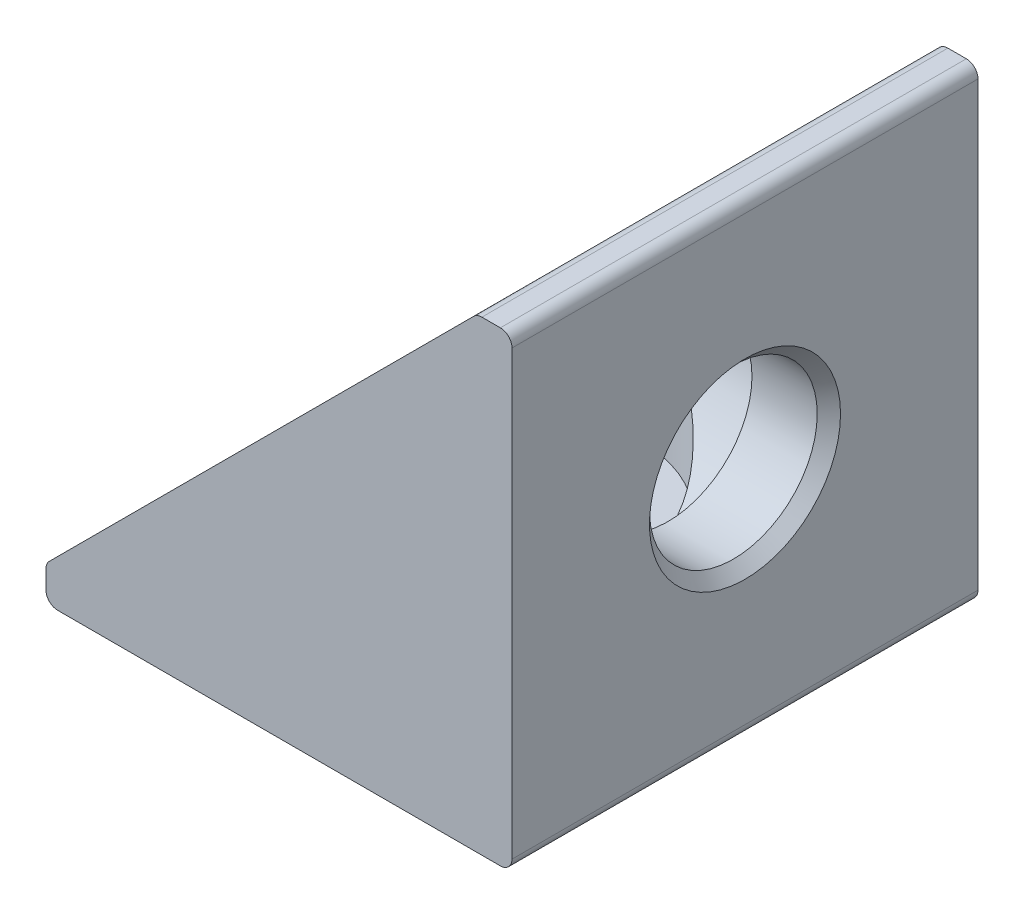
ISO-10303-21;
HEADER;
FILE_DESCRIPTION(('STEP AP214'),'2;1');
FILE_NAME('part.step','',(''),(''),'','','');
FILE_SCHEMA(('AUTOMOTIVE_DESIGN { 1 0 10303 214 1 1 1 1 }'));
ENDSEC;
DATA;
#1=APPLICATION_CONTEXT('core data for automotive mechanical design processes');
#2=APPLICATION_PROTOCOL_DEFINITION('international standard','automotive_design',2000,#1);
#3=PRODUCT_CONTEXT('',#1,'mechanical');
#4=PRODUCT('Part','Part','',(#3));
#5=PRODUCT_RELATED_PRODUCT_CATEGORY('part','',(#4));
#6=PRODUCT_DEFINITION_FORMATION('','',#4);
#7=PRODUCT_DEFINITION_CONTEXT('part definition',#1,'design');
#8=PRODUCT_DEFINITION('design','',#6,#7);
#9=PRODUCT_DEFINITION_SHAPE('','',#8);
#10=(LENGTH_UNIT() NAMED_UNIT(*) SI_UNIT(.MILLI.,.METRE.));
#11=(NAMED_UNIT(*) PLANE_ANGLE_UNIT() SI_UNIT($,.RADIAN.));
#12=(NAMED_UNIT(*) SI_UNIT($,.STERADIAN.) SOLID_ANGLE_UNIT());
#13=UNCERTAINTY_MEASURE_WITH_UNIT(LENGTH_MEASURE(1.E-05),#10,'distance_accuracy_value','');
#14=(GEOMETRIC_REPRESENTATION_CONTEXT(3) GLOBAL_UNCERTAINTY_ASSIGNED_CONTEXT((#13)) GLOBAL_UNIT_ASSIGNED_CONTEXT((#10,
#11,#12)) REPRESENTATION_CONTEXT('',''));
#15=CARTESIAN_POINT('',(0.,0.,0.));
#16=DIRECTION('',(0.,0.,1.));
#17=DIRECTION('',(1.,0.,0.));
#18=AXIS2_PLACEMENT_3D('',#15,#16,#17);
#19=CARTESIAN_POINT('',(-20.,1.5,-20.));
#20=DIRECTION('',(-0.707106781186548,0.707106781186547,0.));
#21=DIRECTION('',(-0.707106781186547,-0.707106781186548,0.));
#22=AXIS2_PLACEMENT_3D('',#19,#20,#21);
#23=PLANE('',#22);
#24=CARTESIAN_POINT('',(-10.,11.5,-10.));
#25=DIRECTION('',(-0.707106781186548,0.707106781186547,0.));
#26=DIRECTION('',(-0.707106781186547,-0.707106781186548,0.));
#27=AXIS2_PLACEMENT_3D('',#24,#25,#26);
#28=ELLIPSE('',#27,7.77817459305202,5.5);
#29=CARTESIAN_POINT('',(-10.75,10.75,-4.55137632057416));
#30=VERTEX_POINT('',#29);
#31=CARTESIAN_POINT('',(-10.75,10.75,-15.4486236794258));
#32=VERTEX_POINT('',#31);
#33=EDGE_CURVE('E127',#30,#32,#28,.T.);
#34=ORIENTED_EDGE('',*,*,#33,.F.);
#35=CARTESIAN_POINT('',(-11.5,10.,-10.));
#36=DIRECTION('',(-0.707106781186548,0.707106781186547,0.));
#37=DIRECTION('',(0.707106781186547,0.707106781186548,0.));
#38=AXIS2_PLACEMENT_3D('',#35,#36,#37);
#39=ELLIPSE('',#38,7.77817459305202,5.5);
#40=EDGE_CURVE('E124',#30,#32,#39,.F.);
#41=ORIENTED_EDGE('',*,*,#40,.T.);
#42=EDGE_LOOP('',(#34,#41));
#43=FACE_BOUND('',#42,.T.);
#44=DIRECTION('',(-0.707106781186547,-0.707106781186548,0.));
#45=VECTOR('',#44,1.);
#46=CARTESIAN_POINT('',(-20.,1.5,0.));
#47=LINE('',#46,#45);
#48=CARTESIAN_POINT('',(-1.64644660940673,19.8535533905933,0.));
#49=VERTEX_POINT('',#48);
#50=CARTESIAN_POINT('',(-19.8535533905933,1.64644660940673,0.));
#51=VERTEX_POINT('',#50);
#52=EDGE_CURVE('E270',#49,#51,#47,.T.);
#53=ORIENTED_EDGE('',*,*,#52,.F.);
#54=DIRECTION('',(0.,0.,1.));
#55=VECTOR('',#54,1.);
#56=CARTESIAN_POINT('',(-1.64644660940673,19.8535533905933,-20.));
#57=LINE('',#56,#55);
#58=CARTESIAN_POINT('',(-1.64644660940673,19.8535533905933,-20.));
#59=VERTEX_POINT('',#58);
#60=EDGE_CURVE('E153',#49,#59,#57,.F.);
#61=ORIENTED_EDGE('',*,*,#60,.T.);
#62=DIRECTION('',(-0.707106781186547,-0.707106781186548,0.));
#63=VECTOR('',#62,1.);
#64=CARTESIAN_POINT('',(-20.,1.5,-20.));
#65=LINE('',#64,#63);
#66=CARTESIAN_POINT('',(-19.8535533905933,1.64644660940673,-20.));
#67=VERTEX_POINT('',#66);
#68=EDGE_CURVE('E278',#59,#67,#65,.T.);
#69=ORIENTED_EDGE('',*,*,#68,.T.);
#70=DIRECTION('',(0.,0.,1.));
#71=VECTOR('',#70,1.);
#72=CARTESIAN_POINT('',(-19.8535533905933,1.64644660940673,-20.));
#73=LINE('',#72,#71);
#74=EDGE_CURVE('E150',#67,#51,#73,.T.);
#75=ORIENTED_EDGE('',*,*,#74,.T.);
#76=EDGE_LOOP('',(#53,#61,#69,#75));
#77=FACE_BOUND('',#76,.T.);
#78=ADVANCED_FACE('F16',(#43,#77),#23,.T.);
#79=CARTESIAN_POINT('',(-10.,16.3,-10.));
#80=DIRECTION('',(0.,-1.,0.));
#81=DIRECTION('',(1.,0.,0.));
#82=AXIS2_PLACEMENT_3D('',#79,#80,#81);
#83=CYLINDRICAL_SURFACE('',#82,5.5);
#84=CARTESIAN_POINT('',(-10.,10.,-10.));
#85=DIRECTION('',(-0.707106781186547,-0.707106781186548,0.));
#86=DIRECTION('',(0.707106781186548,-0.707106781186547,0.));
#87=AXIS2_PLACEMENT_3D('',#84,#85,#86);
#88=ELLIPSE('',#87,7.77817459305202,5.5);
#89=CARTESIAN_POINT('',(-10.,10.,-4.5));
#90=VERTEX_POINT('',#89);
#91=EDGE_CURVE('E117',#30,#90,#88,.F.);
#92=ORIENTED_EDGE('',*,*,#91,.F.);
#93=ORIENTED_EDGE('',*,*,#33,.T.);
#94=CARTESIAN_POINT('',(-10.,10.,-15.5));
#95=VERTEX_POINT('',#94);
#96=EDGE_CURVE('E129',#95,#32,#88,.F.);
#97=ORIENTED_EDGE('',*,*,#96,.F.);
#98=CARTESIAN_POINT('',(-10.,10.,-10.));
#99=DIRECTION('',(0.707106781186548,-0.707106781186547,0.));
#100=DIRECTION('',(-0.707106781186547,-0.707106781186548,0.));
#101=AXIS2_PLACEMENT_3D('',#98,#99,#100);
#102=ELLIPSE('',#101,7.77817459305202,5.5);
#103=EDGE_CURVE('E112',#90,#95,#102,.F.);
#104=ORIENTED_EDGE('',*,*,#103,.F.);
#105=EDGE_LOOP('',(#92,#93,#97,#104));
#106=FACE_BOUND('',#105,.T.);
#107=ADVANCED_FACE('F130',(#106),#83,.F.);
#108=CARTESIAN_POINT('',(-10.,3.3,-10.));
#109=DIRECTION('',(0.,-1.,0.));
#110=DIRECTION('',(1.,0.,0.));
#111=AXIS2_PLACEMENT_3D('',#108,#109,#110);
#112=CIRCLE('',#111,5.5);
#113=CARTESIAN_POINT('',(-4.5,3.3,-10.));
#114=VERTEX_POINT('',#113);
#115=EDGE_CURVE('E298',#114,#114,#112,.T.);
#116=ORIENTED_EDGE('',*,*,#115,.T.);
#117=EDGE_LOOP('',(#116));
#118=FACE_BOUND('',#117,.T.);
#119=CARTESIAN_POINT('',(-10.,10.,-10.));
#120=DIRECTION('',(0.707106781186548,-0.707106781186547,0.));
#121=DIRECTION('',(-0.707106781186547,-0.707106781186548,0.));
#122=AXIS2_PLACEMENT_3D('',#119,#120,#121);
#123=ELLIPSE('',#122,7.77817459305202,5.5);
#124=EDGE_CURVE('E116',#90,#95,#123,.T.);
#125=ORIENTED_EDGE('',*,*,#124,.F.);
#126=CARTESIAN_POINT('',(-10.,10.,-10.));
#127=DIRECTION('',(-0.707106781186547,-0.707106781186548,0.));
#128=DIRECTION('',(0.707106781186548,-0.707106781186547,0.));
#129=AXIS2_PLACEMENT_3D('',#126,#127,#128);
#130=ELLIPSE('',#129,7.77817459305202,5.5);
#131=EDGE_CURVE('E108',#95,#90,#130,.T.);
#132=ORIENTED_EDGE('',*,*,#131,.F.);
#133=EDGE_LOOP('',(#125,#132));
#134=FACE_BOUND('',#133,.T.);
#135=ADVANCED_FACE('F132',(#118,#134),#83,.F.);
#136=CARTESIAN_POINT('',(0.,0.,-20.));
#137=DIRECTION('',(0.,-1.,0.));
#138=DIRECTION('',(1.,0.,0.));
#139=AXIS2_PLACEMENT_3D('',#136,#137,#138);
#140=PLANE('',#139);
#141=CARTESIAN_POINT('',(-10.,0.,-10.));
#142=DIRECTION('',(0.,-1.,0.));
#143=DIRECTION('',(1.,0.,0.));
#144=AXIS2_PLACEMENT_3D('',#141,#142,#143);
#145=CIRCLE('',#144,4.1);
#146=CARTESIAN_POINT('',(-5.9,0.,-10.));
#147=VERTEX_POINT('',#146);
#148=EDGE_CURVE('E178',#147,#147,#145,.F.);
#149=ORIENTED_EDGE('',*,*,#148,.T.);
#150=EDGE_LOOP('',(#149));
#151=FACE_BOUND('',#150,.T.);
#152=DIRECTION('',(1.,0.,0.));
#153=VECTOR('',#152,1.);
#154=CARTESIAN_POINT('',(0.,0.,0.));
#155=LINE('',#154,#153);
#156=CARTESIAN_POINT('',(-19.5,0.,0.));
#157=VERTEX_POINT('',#156);
#158=CARTESIAN_POINT('',(-0.5,0.,0.));
#159=VERTEX_POINT('',#158);
#160=EDGE_CURVE('E284',#157,#159,#155,.T.);
#161=ORIENTED_EDGE('',*,*,#160,.F.);
#162=DIRECTION('',(0.,0.,1.));
#163=VECTOR('',#162,1.);
#164=CARTESIAN_POINT('',(-19.5,0.,-20.));
#165=LINE('',#164,#163);
#166=CARTESIAN_POINT('',(-19.5,0.,-20.));
#167=VERTEX_POINT('',#166);
#168=EDGE_CURVE('E172',#157,#167,#165,.F.);
#169=ORIENTED_EDGE('',*,*,#168,.T.);
#170=DIRECTION('',(1.,0.,0.));
#171=VECTOR('',#170,1.);
#172=CARTESIAN_POINT('',(0.,0.,-20.));
#173=LINE('',#172,#171);
#174=CARTESIAN_POINT('',(-0.5,0.,-20.));
#175=VERTEX_POINT('',#174);
#176=EDGE_CURVE('E258',#167,#175,#173,.T.);
#177=ORIENTED_EDGE('',*,*,#176,.T.);
#178=DIRECTION('',(0.,0.,1.));
#179=VECTOR('',#178,1.);
#180=CARTESIAN_POINT('',(-0.5,0.,-20.));
#181=LINE('',#180,#179);
#182=EDGE_CURVE('E169',#175,#159,#181,.T.);
#183=ORIENTED_EDGE('',*,*,#182,.T.);
#184=EDGE_LOOP('',(#161,#169,#177,#183));
#185=FACE_BOUND('',#184,.T.);
#186=ADVANCED_FACE('F220',(#151,#185),#140,.T.);
#187=CARTESIAN_POINT('',(-20.,0.,-20.));
#188=DIRECTION('',(-1.,0.,0.));
#189=DIRECTION('',(0.,0.,1.));
#190=AXIS2_PLACEMENT_3D('',#187,#188,#189);
#191=PLANE('',#190);
#192=DIRECTION('',(0.,-1.,0.));
#193=VECTOR('',#192,1.);
#194=CARTESIAN_POINT('',(-20.,0.,0.));
#195=LINE('',#194,#193);
#196=CARTESIAN_POINT('',(-20.,1.29289321881345,0.));
#197=VERTEX_POINT('',#196);
#198=CARTESIAN_POINT('',(-20.,0.499999999999998,0.));
#199=VERTEX_POINT('',#198);
#200=EDGE_CURVE('E265',#197,#199,#195,.T.);
#201=ORIENTED_EDGE('',*,*,#200,.F.);
#202=DIRECTION('',(0.,0.,1.));
#203=VECTOR('',#202,1.);
#204=CARTESIAN_POINT('',(-20.,1.29289321881345,-20.));
#205=LINE('',#204,#203);
#206=CARTESIAN_POINT('',(-20.,1.29289321881345,-20.));
#207=VERTEX_POINT('',#206);
#208=EDGE_CURVE('E167',#197,#207,#205,.F.);
#209=ORIENTED_EDGE('',*,*,#208,.T.);
#210=DIRECTION('',(0.,-1.,0.));
#211=VECTOR('',#210,1.);
#212=CARTESIAN_POINT('',(-20.,0.,-20.));
#213=LINE('',#212,#211);
#214=CARTESIAN_POINT('',(-20.,0.499999999999998,-20.));
#215=VERTEX_POINT('',#214);
#216=EDGE_CURVE('E281',#207,#215,#213,.T.);
#217=ORIENTED_EDGE('',*,*,#216,.T.);
#218=DIRECTION('',(0.,0.,1.));
#219=VECTOR('',#218,1.);
#220=CARTESIAN_POINT('',(-20.,0.499999999999998,-20.));
#221=LINE('',#220,#219);
#222=EDGE_CURVE('E164',#215,#199,#221,.T.);
#223=ORIENTED_EDGE('',*,*,#222,.T.);
#224=EDGE_LOOP('',(#201,#209,#217,#223));
#225=FACE_BOUND('',#224,.T.);
#226=ADVANCED_FACE('F209',(#225),#191,.T.);
#227=CARTESIAN_POINT('',(0.,20.,-20.));
#228=DIRECTION('',(0.,1.,0.));
#229=DIRECTION('',(0.,0.,1.));
#230=AXIS2_PLACEMENT_3D('',#227,#228,#229);
#231=PLANE('',#230);
#232=DIRECTION('',(-1.,0.,0.));
#233=VECTOR('',#232,1.);
#234=CARTESIAN_POINT('',(0.,20.,-20.));
#235=LINE('',#234,#233);
#236=CARTESIAN_POINT('',(-0.5,20.,-20.));
#237=VERTEX_POINT('',#236);
#238=CARTESIAN_POINT('',(-1.29289321881345,20.,-20.));
#239=VERTEX_POINT('',#238);
#240=EDGE_CURVE('E267',#237,#239,#235,.T.);
#241=ORIENTED_EDGE('',*,*,#240,.T.);
#242=DIRECTION('',(0.,0.,1.));
#243=VECTOR('',#242,1.);
#244=CARTESIAN_POINT('',(-1.29289321881345,20.,-20.));
#245=LINE('',#244,#243);
#246=CARTESIAN_POINT('',(-1.29289321881345,20.,0.));
#247=VERTEX_POINT('',#246);
#248=EDGE_CURVE('E137',#239,#247,#245,.T.);
#249=ORIENTED_EDGE('',*,*,#248,.T.);
#250=DIRECTION('',(-1.,0.,0.));
#251=VECTOR('',#250,1.);
#252=CARTESIAN_POINT('',(0.,20.,0.));
#253=LINE('',#252,#251);
#254=CARTESIAN_POINT('',(-0.5,20.,0.));
#255=VERTEX_POINT('',#254);
#256=EDGE_CURVE('E290',#255,#247,#253,.T.);
#257=ORIENTED_EDGE('',*,*,#256,.F.);
#258=DIRECTION('',(0.,0.,1.));
#259=VECTOR('',#258,1.);
#260=CARTESIAN_POINT('',(-0.5,20.,-20.));
#261=LINE('',#260,#259);
#262=EDGE_CURVE('E135',#255,#237,#261,.F.);
#263=ORIENTED_EDGE('',*,*,#262,.T.);
#264=EDGE_LOOP('',(#241,#249,#257,#263));
#265=FACE_BOUND('',#264,.T.);
#266=ADVANCED_FACE('F211',(#265),#231,.T.);
#267=CARTESIAN_POINT('',(0.,0.,-20.));
#268=DIRECTION('',(1.,0.,0.));
#269=DIRECTION('',(0.,0.,-1.));
#270=AXIS2_PLACEMENT_3D('',#267,#268,#269);
#271=PLANE('',#270);
#272=CARTESIAN_POINT('',(0.,10.,-10.));
#273=DIRECTION('',(1.,0.,0.));
#274=DIRECTION('',(0.,0.,-1.));
#275=AXIS2_PLACEMENT_3D('',#272,#273,#274);
#276=CIRCLE('',#275,4.10000000000001);
#277=CARTESIAN_POINT('',(0.,10.,-14.1));
#278=VERTEX_POINT('',#277);
#279=EDGE_CURVE('E10',#278,#278,#276,.F.);
#280=ORIENTED_EDGE('',*,*,#279,.T.);
#281=EDGE_LOOP('',(#280));
#282=FACE_BOUND('',#281,.T.);
#283=DIRECTION('',(0.,1.,0.));
#284=VECTOR('',#283,1.);
#285=CARTESIAN_POINT('',(0.,0.,-20.));
#286=LINE('',#285,#284);
#287=CARTESIAN_POINT('',(0.,0.5,-20.));
#288=VERTEX_POINT('',#287);
#289=CARTESIAN_POINT('',(0.,19.5,-20.));
#290=VERTEX_POINT('',#289);
#291=EDGE_CURVE('E260',#288,#290,#286,.T.);
#292=ORIENTED_EDGE('',*,*,#291,.T.);
#293=DIRECTION('',(0.,0.,1.));
#294=VECTOR('',#293,1.);
#295=CARTESIAN_POINT('',(0.,19.5,-20.));
#296=LINE('',#295,#294);
#297=CARTESIAN_POINT('',(0.,19.5,0.));
#298=VERTEX_POINT('',#297);
#299=EDGE_CURVE('E175',#290,#298,#296,.T.);
#300=ORIENTED_EDGE('',*,*,#299,.T.);
#301=DIRECTION('',(0.,1.,0.));
#302=VECTOR('',#301,1.);
#303=CARTESIAN_POINT('',(0.,0.,0.));
#304=LINE('',#303,#302);
#305=CARTESIAN_POINT('',(0.,0.5,0.));
#306=VERTEX_POINT('',#305);
#307=EDGE_CURVE('E286',#306,#298,#304,.T.);
#308=ORIENTED_EDGE('',*,*,#307,.F.);
#309=DIRECTION('',(0.,0.,1.));
#310=VECTOR('',#309,1.);
#311=CARTESIAN_POINT('',(0.,0.5,-20.));
#312=LINE('',#311,#310);
#313=EDGE_CURVE('E39',#306,#288,#312,.F.);
#314=ORIENTED_EDGE('',*,*,#313,.T.);
#315=EDGE_LOOP('',(#292,#300,#308,#314));
#316=FACE_BOUND('',#315,.T.);
#317=ADVANCED_FACE('F214',(#282,#316),#271,.T.);
#318=CARTESIAN_POINT('',(0.,0.,-20.));
#319=DIRECTION('',(0.,0.,-1.));
#320=DIRECTION('',(-1.,0.,0.));
#321=AXIS2_PLACEMENT_3D('',#318,#319,#320);
#322=PLANE('',#321);
#323=ORIENTED_EDGE('',*,*,#68,.F.);
#324=CARTESIAN_POINT('',(-1.29289321881345,19.5,-20.));
#325=DIRECTION('',(0.,0.,-1.));
#326=DIRECTION('',(-1.,0.,0.));
#327=AXIS2_PLACEMENT_3D('',#324,#325,#326);
#328=CIRCLE('',#327,0.5);
#329=EDGE_CURVE('E162',#59,#239,#328,.T.);
#330=ORIENTED_EDGE('',*,*,#329,.T.);
#331=ORIENTED_EDGE('',*,*,#240,.F.);
#332=CARTESIAN_POINT('',(-0.5,19.5,-20.));
#333=DIRECTION('',(0.,0.,-1.));
#334=DIRECTION('',(-1.,0.,0.));
#335=AXIS2_PLACEMENT_3D('',#332,#333,#334);
#336=CIRCLE('',#335,0.5);
#337=EDGE_CURVE('E32',#237,#290,#336,.T.);
#338=ORIENTED_EDGE('',*,*,#337,.T.);
#339=ORIENTED_EDGE('',*,*,#291,.F.);
#340=CARTESIAN_POINT('',(-0.5,0.5,-20.));
#341=DIRECTION('',(0.,0.,-1.));
#342=DIRECTION('',(-1.,0.,0.));
#343=AXIS2_PLACEMENT_3D('',#340,#341,#342);
#344=CIRCLE('',#343,0.5);
#345=EDGE_CURVE('E155',#288,#175,#344,.T.);
#346=ORIENTED_EDGE('',*,*,#345,.T.);
#347=ORIENTED_EDGE('',*,*,#176,.F.);
#348=CARTESIAN_POINT('',(-19.5,0.499999999999998,-20.));
#349=DIRECTION('',(0.,0.,-1.));
#350=DIRECTION('',(-1.,0.,0.));
#351=AXIS2_PLACEMENT_3D('',#348,#349,#350);
#352=CIRCLE('',#351,0.5);
#353=EDGE_CURVE('E158',#167,#215,#352,.T.);
#354=ORIENTED_EDGE('',*,*,#353,.T.);
#355=ORIENTED_EDGE('',*,*,#216,.F.);
#356=CARTESIAN_POINT('',(-19.5,1.29289321881345,-20.));
#357=DIRECTION('',(0.,0.,-1.));
#358=DIRECTION('',(-1.,0.,0.));
#359=AXIS2_PLACEMENT_3D('',#356,#357,#358);
#360=CIRCLE('',#359,0.5);
#361=EDGE_CURVE('E160',#207,#67,#360,.T.);
#362=ORIENTED_EDGE('',*,*,#361,.T.);
#363=EDGE_LOOP('',(#323,#330,#331,#338,#339,#346,#347,#354,#355,#362));
#364=FACE_BOUND('',#363,.T.);
#365=ADVANCED_FACE('F218',(#364),#322,.T.);
#366=CARTESIAN_POINT('',(0.,0.,0.));
#367=DIRECTION('',(0.,0.,-1.));
#368=DIRECTION('',(-1.,0.,0.));
#369=AXIS2_PLACEMENT_3D('',#366,#367,#368);
#370=PLANE('',#369);
#371=ORIENTED_EDGE('',*,*,#256,.T.);
#372=CARTESIAN_POINT('',(-1.29289321881345,19.5,0.));
#373=DIRECTION('',(0.,0.,-1.));
#374=DIRECTION('',(-1.,0.,0.));
#375=AXIS2_PLACEMENT_3D('',#372,#373,#374);
#376=CIRCLE('',#375,0.5);
#377=EDGE_CURVE('E148',#247,#49,#376,.F.);
#378=ORIENTED_EDGE('',*,*,#377,.T.);
#379=ORIENTED_EDGE('',*,*,#52,.T.);
#380=CARTESIAN_POINT('',(-19.5,1.29289321881345,0.));
#381=DIRECTION('',(0.,0.,-1.));
#382=DIRECTION('',(-1.,0.,0.));
#383=AXIS2_PLACEMENT_3D('',#380,#381,#382);
#384=CIRCLE('',#383,0.5);
#385=EDGE_CURVE('E146',#51,#197,#384,.F.);
#386=ORIENTED_EDGE('',*,*,#385,.T.);
#387=ORIENTED_EDGE('',*,*,#200,.T.);
#388=CARTESIAN_POINT('',(-19.5,0.499999999999998,0.));
#389=DIRECTION('',(0.,0.,-1.));
#390=DIRECTION('',(-1.,0.,0.));
#391=AXIS2_PLACEMENT_3D('',#388,#389,#390);
#392=CIRCLE('',#391,0.5);
#393=EDGE_CURVE('E144',#199,#157,#392,.F.);
#394=ORIENTED_EDGE('',*,*,#393,.T.);
#395=ORIENTED_EDGE('',*,*,#160,.T.);
#396=CARTESIAN_POINT('',(-0.5,0.5,0.));
#397=DIRECTION('',(0.,0.,-1.));
#398=DIRECTION('',(-1.,0.,0.));
#399=AXIS2_PLACEMENT_3D('',#396,#397,#398);
#400=CIRCLE('',#399,0.5);
#401=EDGE_CURVE('E140',#159,#306,#400,.F.);
#402=ORIENTED_EDGE('',*,*,#401,.T.);
#403=ORIENTED_EDGE('',*,*,#307,.T.);
#404=CARTESIAN_POINT('',(-0.5,19.5,0.));
#405=DIRECTION('',(0.,0.,-1.));
#406=DIRECTION('',(-1.,0.,0.));
#407=AXIS2_PLACEMENT_3D('',#404,#405,#406);
#408=CIRCLE('',#407,0.5);
#409=EDGE_CURVE('E142',#298,#255,#408,.F.);
#410=ORIENTED_EDGE('',*,*,#409,.T.);
#411=EDGE_LOOP('',(#371,#378,#379,#386,#387,#394,#395,#402,#403,#410));
#412=FACE_BOUND('',#411,.T.);
#413=ADVANCED_FACE('F324',(#412),#370,.F.);
#414=CARTESIAN_POINT('',(-3.3,10.,-10.));
#415=DIRECTION('',(1.,0.,0.));
#416=DIRECTION('',(0.,0.,-1.));
#417=AXIS2_PLACEMENT_3D('',#414,#415,#416);
#418=CYLINDRICAL_SURFACE('',#417,3.6);
#419=CARTESIAN_POINT('',(-0.500000000000005,10.,-10.));
#420=DIRECTION('',(1.,0.,0.));
#421=DIRECTION('',(0.,0.,-1.));
#422=AXIS2_PLACEMENT_3D('',#419,#420,#421);
#423=CIRCLE('',#422,3.6);
#424=CARTESIAN_POINT('',(-0.500000000000005,10.,-13.6));
#425=VERTEX_POINT('',#424);
#426=EDGE_CURVE('E25',#425,#425,#423,.T.);
#427=ORIENTED_EDGE('',*,*,#426,.T.);
#428=EDGE_LOOP('',(#427));
#429=FACE_BOUND('',#428,.T.);
#430=CARTESIAN_POINT('',(-3.3,10.,-10.));
#431=DIRECTION('',(1.,0.,0.));
#432=DIRECTION('',(0.,0.,-1.));
#433=AXIS2_PLACEMENT_3D('',#430,#431,#432);
#434=CIRCLE('',#433,3.6);
#435=CARTESIAN_POINT('',(-3.3,10.,-13.6));
#436=VERTEX_POINT('',#435);
#437=EDGE_CURVE('E273',#436,#436,#434,.T.);
#438=ORIENTED_EDGE('',*,*,#437,.F.);
#439=EDGE_LOOP('',(#438));
#440=FACE_BOUND('',#439,.T.);
#441=ADVANCED_FACE('F186',(#429,#440),#418,.F.);
#442=CARTESIAN_POINT('',(-10.,3.3,-10.));
#443=DIRECTION('',(0.,-1.,0.));
#444=DIRECTION('',(1.,0.,0.));
#445=AXIS2_PLACEMENT_3D('',#442,#443,#444);
#446=CYLINDRICAL_SURFACE('',#445,3.6);
#447=CARTESIAN_POINT('',(-10.,0.500000000000002,-10.));
#448=DIRECTION('',(0.,-1.,0.));
#449=DIRECTION('',(0.,0.,-1.));
#450=AXIS2_PLACEMENT_3D('',#447,#448,#449);
#451=CIRCLE('',#450,3.6);
#452=CARTESIAN_POINT('',(-10.,0.500000000000002,-13.6));
#453=VERTEX_POINT('',#452);
#454=EDGE_CURVE('E181',#453,#453,#451,.T.);
#455=ORIENTED_EDGE('',*,*,#454,.T.);
#456=EDGE_LOOP('',(#455));
#457=FACE_BOUND('',#456,.T.);
#458=CARTESIAN_POINT('',(-10.,3.3,-10.));
#459=DIRECTION('',(0.,1.,0.));
#460=DIRECTION('',(0.,0.,-1.));
#461=AXIS2_PLACEMENT_3D('',#458,#459,#460);
#462=CIRCLE('',#461,3.6);
#463=CARTESIAN_POINT('',(-10.,3.3,-13.6));
#464=VERTEX_POINT('',#463);
#465=EDGE_CURVE('E287',#464,#464,#462,.T.);
#466=ORIENTED_EDGE('',*,*,#465,.T.);
#467=EDGE_LOOP('',(#466));
#468=FACE_BOUND('',#467,.T.);
#469=ADVANCED_FACE('F306',(#457,#468),#446,.F.);
#470=CARTESIAN_POINT('',(-10.,3.3,-10.));
#471=DIRECTION('',(0.,-1.,0.));
#472=DIRECTION('',(1.,0.,0.));
#473=AXIS2_PLACEMENT_3D('',#470,#471,#472);
#474=PLANE('',#473);
#475=ORIENTED_EDGE('',*,*,#115,.F.);
#476=EDGE_LOOP('',(#475));
#477=FACE_BOUND('',#476,.T.);
#478=ORIENTED_EDGE('',*,*,#465,.F.);
#479=EDGE_LOOP('',(#478));
#480=FACE_BOUND('',#479,.T.);
#481=ADVANCED_FACE('F308',(#477,#480),#474,.F.);
#482=CARTESIAN_POINT('',(-16.3,10.,-10.));
#483=DIRECTION('',(1.,0.,0.));
#484=DIRECTION('',(0.,1.,0.));
#485=AXIS2_PLACEMENT_3D('',#482,#483,#484);
#486=CYLINDRICAL_SURFACE('',#485,5.5);
#487=ORIENTED_EDGE('',*,*,#40,.F.);
#488=ORIENTED_EDGE('',*,*,#91,.T.);
#489=ORIENTED_EDGE('',*,*,#124,.T.);
#490=ORIENTED_EDGE('',*,*,#96,.T.);
#491=EDGE_LOOP('',(#487,#488,#489,#490));
#492=FACE_BOUND('',#491,.T.);
#493=ADVANCED_FACE('F122',(#492),#486,.F.);
#494=CARTESIAN_POINT('',(-3.3,10.,-10.));
#495=DIRECTION('',(-1.,0.,0.));
#496=DIRECTION('',(0.,-1.,0.));
#497=AXIS2_PLACEMENT_3D('',#494,#495,#496);
#498=CIRCLE('',#497,5.5);
#499=CARTESIAN_POINT('',(-3.3,4.5,-10.));
#500=VERTEX_POINT('',#499);
#501=EDGE_CURVE('E295',#500,#500,#498,.T.);
#502=ORIENTED_EDGE('',*,*,#501,.F.);
#503=EDGE_LOOP('',(#502));
#504=FACE_BOUND('',#503,.T.);
#505=ORIENTED_EDGE('',*,*,#103,.T.);
#506=ORIENTED_EDGE('',*,*,#131,.T.);
#507=EDGE_LOOP('',(#505,#506));
#508=FACE_BOUND('',#507,.T.);
#509=ADVANCED_FACE('F110',(#504,#508),#486,.F.);
#510=CARTESIAN_POINT('',(-3.3,10.,-10.));
#511=DIRECTION('',(1.,0.,0.));
#512=DIRECTION('',(0.,-1.,0.));
#513=AXIS2_PLACEMENT_3D('',#510,#511,#512);
#514=PLANE('',#513);
#515=ORIENTED_EDGE('',*,*,#437,.T.);
#516=EDGE_LOOP('',(#515));
#517=FACE_BOUND('',#516,.T.);
#518=ORIENTED_EDGE('',*,*,#501,.T.);
#519=EDGE_LOOP('',(#518));
#520=FACE_BOUND('',#519,.T.);
#521=ADVANCED_FACE('F228',(#517,#520),#514,.F.);
#522=CARTESIAN_POINT('',(-1.29289321881345,19.5,-20.));
#523=DIRECTION('',(0.,0.,1.));
#524=DIRECTION('',(1.,0.,0.));
#525=AXIS2_PLACEMENT_3D('',#522,#523,#524);
#526=CYLINDRICAL_SURFACE('',#525,0.5);
#527=ORIENTED_EDGE('',*,*,#329,.F.);
#528=ORIENTED_EDGE('',*,*,#60,.F.);
#529=ORIENTED_EDGE('',*,*,#377,.F.);
#530=ORIENTED_EDGE('',*,*,#248,.F.);
#531=EDGE_LOOP('',(#527,#528,#529,#530));
#532=FACE_BOUND('',#531,.T.);
#533=ADVANCED_FACE('F224',(#532),#526,.T.);
#534=CARTESIAN_POINT('',(-19.5,1.29289321881345,-20.));
#535=DIRECTION('',(0.,0.,1.));
#536=DIRECTION('',(1.,0.,0.));
#537=AXIS2_PLACEMENT_3D('',#534,#535,#536);
#538=CYLINDRICAL_SURFACE('',#537,0.5);
#539=ORIENTED_EDGE('',*,*,#361,.F.);
#540=ORIENTED_EDGE('',*,*,#208,.F.);
#541=ORIENTED_EDGE('',*,*,#385,.F.);
#542=ORIENTED_EDGE('',*,*,#74,.F.);
#543=EDGE_LOOP('',(#539,#540,#541,#542));
#544=FACE_BOUND('',#543,.T.);
#545=ADVANCED_FACE('F227',(#544),#538,.T.);
#546=CARTESIAN_POINT('',(-19.5,0.499999999999998,-20.));
#547=DIRECTION('',(0.,0.,1.));
#548=DIRECTION('',(1.,0.,0.));
#549=AXIS2_PLACEMENT_3D('',#546,#547,#548);
#550=CYLINDRICAL_SURFACE('',#549,0.5);
#551=ORIENTED_EDGE('',*,*,#353,.F.);
#552=ORIENTED_EDGE('',*,*,#168,.F.);
#553=ORIENTED_EDGE('',*,*,#393,.F.);
#554=ORIENTED_EDGE('',*,*,#222,.F.);
#555=EDGE_LOOP('',(#551,#552,#553,#554));
#556=FACE_BOUND('',#555,.T.);
#557=ADVANCED_FACE('F232',(#556),#550,.T.);
#558=CARTESIAN_POINT('',(-0.5,19.5,-20.));
#559=DIRECTION('',(0.,0.,1.));
#560=DIRECTION('',(1.,0.,0.));
#561=AXIS2_PLACEMENT_3D('',#558,#559,#560);
#562=CYLINDRICAL_SURFACE('',#561,0.5);
#563=ORIENTED_EDGE('',*,*,#337,.F.);
#564=ORIENTED_EDGE('',*,*,#262,.F.);
#565=ORIENTED_EDGE('',*,*,#409,.F.);
#566=ORIENTED_EDGE('',*,*,#299,.F.);
#567=EDGE_LOOP('',(#563,#564,#565,#566));
#568=FACE_BOUND('',#567,.T.);
#569=ADVANCED_FACE('F236',(#568),#562,.T.);
#570=CARTESIAN_POINT('',(-0.5,0.5,-20.));
#571=DIRECTION('',(0.,0.,1.));
#572=DIRECTION('',(1.,0.,0.));
#573=AXIS2_PLACEMENT_3D('',#570,#571,#572);
#574=CYLINDRICAL_SURFACE('',#573,0.5);
#575=ORIENTED_EDGE('',*,*,#345,.F.);
#576=ORIENTED_EDGE('',*,*,#313,.F.);
#577=ORIENTED_EDGE('',*,*,#401,.F.);
#578=ORIENTED_EDGE('',*,*,#182,.F.);
#579=EDGE_LOOP('',(#575,#576,#577,#578));
#580=FACE_BOUND('',#579,.T.);
#581=ADVANCED_FACE('F196',(#580),#574,.T.);
#582=CARTESIAN_POINT('',(-10.,0.,-10.));
#583=DIRECTION('',(0.,-1.,0.));
#584=DIRECTION('',(0.,0.,-1.));
#585=AXIS2_PLACEMENT_3D('',#582,#583,#584);
#586=CONICAL_SURFACE('',#585,4.1,0.785398163397444);
#587=ORIENTED_EDGE('',*,*,#454,.F.);
#588=EDGE_LOOP('',(#587));
#589=FACE_BOUND('',#588,.T.);
#590=ORIENTED_EDGE('',*,*,#148,.F.);
#591=EDGE_LOOP('',(#590));
#592=FACE_BOUND('',#591,.T.);
#593=ADVANCED_FACE('F190',(#589,#592),#586,.F.);
#594=CARTESIAN_POINT('',(-0.500000000000005,10.,-10.));
#595=DIRECTION('',(1.,0.,0.));
#596=DIRECTION('',(0.,0.,-1.));
#597=AXIS2_PLACEMENT_3D('',#594,#595,#596);
#598=CONICAL_SURFACE('',#597,3.6,0.785398163397452);
#599=ORIENTED_EDGE('',*,*,#279,.F.);
#600=EDGE_LOOP('',(#599));
#601=FACE_BOUND('',#600,.T.);
#602=ORIENTED_EDGE('',*,*,#426,.F.);
#603=EDGE_LOOP('',(#602));
#604=FACE_BOUND('',#603,.T.);
#605=ADVANCED_FACE('F19',(#601,#604),#598,.F.);
#606=CLOSED_SHELL('',(#78,#107,#135,#186,#226,#266,#317,#365,#413,#441,#469,#481,#493,#509,#521,
#533,#545,#557,#569,#581,#593,#605));
#607=MANIFOLD_SOLID_BREP('B1',#606);
#608=ADVANCED_BREP_SHAPE_REPRESENTATION('',(#18,#607),#14);
#609=SHAPE_DEFINITION_REPRESENTATION(#9,#608);
ENDSEC;
END-ISO-10303-21;
